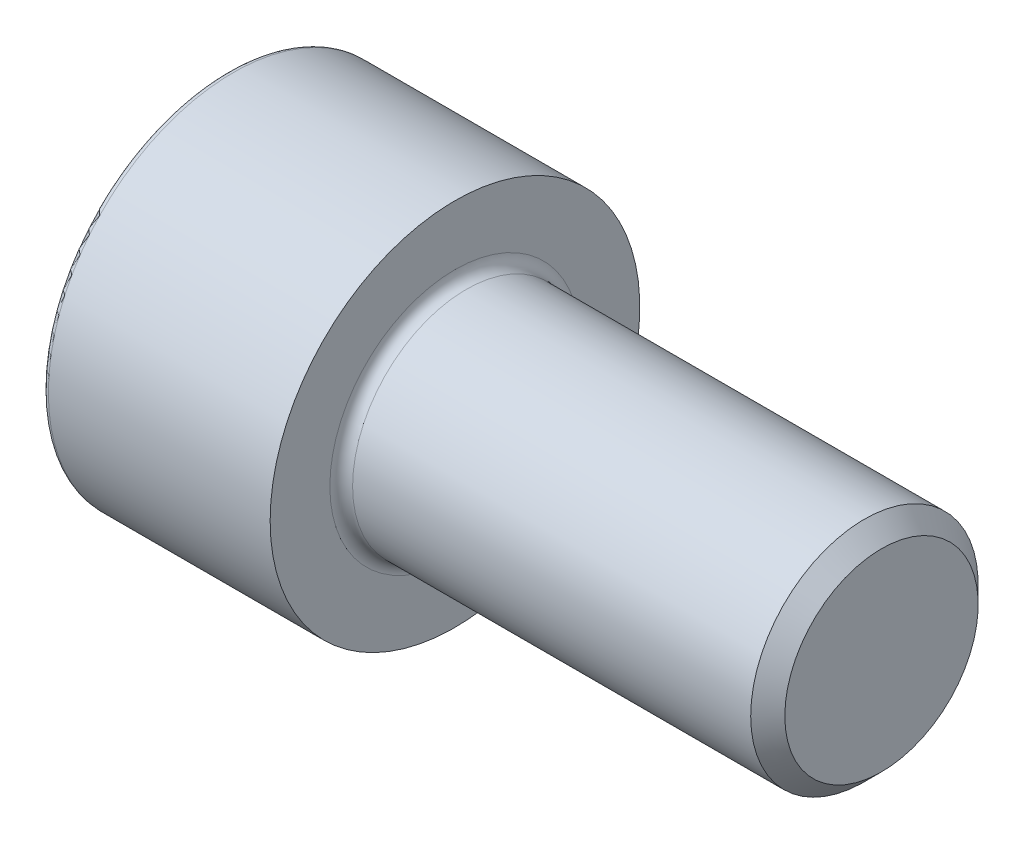
ISO-10303-21;
HEADER;
FILE_DESCRIPTION(('STEP AP214'),'2;1');
FILE_NAME('part.step','',(''),(''),'','','');
FILE_SCHEMA(('AUTOMOTIVE_DESIGN { 1 0 10303 214 1 1 1 1 }'));
ENDSEC;
DATA;
#1=APPLICATION_CONTEXT('core data for automotive mechanical design processes');
#2=APPLICATION_PROTOCOL_DEFINITION('international standard','automotive_design',2000,#1);
#3=PRODUCT_CONTEXT('',#1,'mechanical');
#4=PRODUCT('Part','Part','',(#3));
#5=PRODUCT_RELATED_PRODUCT_CATEGORY('part','',(#4));
#6=PRODUCT_DEFINITION_FORMATION('','',#4);
#7=PRODUCT_DEFINITION_CONTEXT('part definition',#1,'design');
#8=PRODUCT_DEFINITION('design','',#6,#7);
#9=PRODUCT_DEFINITION_SHAPE('','',#8);
#10=(LENGTH_UNIT() NAMED_UNIT(*) SI_UNIT(.MILLI.,.METRE.));
#11=(NAMED_UNIT(*) PLANE_ANGLE_UNIT() SI_UNIT($,.RADIAN.));
#12=(NAMED_UNIT(*) SI_UNIT($,.STERADIAN.) SOLID_ANGLE_UNIT());
#13=UNCERTAINTY_MEASURE_WITH_UNIT(LENGTH_MEASURE(1.E-05),#10,'distance_accuracy_value','');
#14=(GEOMETRIC_REPRESENTATION_CONTEXT(3) GLOBAL_UNCERTAINTY_ASSIGNED_CONTEXT((#13)) GLOBAL_UNIT_ASSIGNED_CONTEXT((#10,
#11,#12)) REPRESENTATION_CONTEXT('',''));
#15=CARTESIAN_POINT('',(0.,0.,0.));
#16=DIRECTION('',(0.,0.,1.));
#17=DIRECTION('',(1.,0.,0.));
#18=AXIS2_PLACEMENT_3D('',#15,#16,#17);
#19=CARTESIAN_POINT('',(0.,0.,0.));
#20=DIRECTION('',(1.,0.,0.));
#21=DIRECTION('',(0.,0.,-1.));
#22=AXIS2_PLACEMENT_3D('',#19,#20,#21);
#23=PLANE('',#22);
#24=CARTESIAN_POINT('',(0.,0.,0.));
#25=DIRECTION('',(1.,0.,0.));
#26=DIRECTION('',(0.,0.,-1.));
#27=AXIS2_PLACEMENT_3D('',#24,#25,#26);
#28=CIRCLE('',#27,6.3);
#29=CARTESIAN_POINT('',(0.,0.,-6.3));
#30=VERTEX_POINT('',#29);
#31=EDGE_CURVE('E180',#30,#30,#28,.F.);
#32=ORIENTED_EDGE('',*,*,#31,.T.);
#33=EDGE_LOOP('',(#32));
#34=FACE_BOUND('',#33,.T.);
#35=DIRECTION('',(0.,0.5,-0.866025403784439));
#36=VECTOR('',#35,1.);
#37=CARTESIAN_POINT('',(0.,1.73205080756887,3.));
#38=LINE('',#37,#36);
#39=CARTESIAN_POINT('',(0.,1.73205080756887,3.));
#40=VERTEX_POINT('',#39);
#41=CARTESIAN_POINT('',(0.,3.46410161513775,0.));
#42=VERTEX_POINT('',#41);
#43=EDGE_CURVE('E149',#40,#42,#38,.T.);
#44=ORIENTED_EDGE('',*,*,#43,.F.);
#45=DIRECTION('',(0.,1.,0.));
#46=VECTOR('',#45,1.);
#47=CARTESIAN_POINT('',(0.,-1.73205080756888,3.));
#48=LINE('',#47,#46);
#49=CARTESIAN_POINT('',(0.,-1.73205080756888,3.));
#50=VERTEX_POINT('',#49);
#51=EDGE_CURVE('E51',#50,#40,#48,.T.);
#52=ORIENTED_EDGE('',*,*,#51,.F.);
#53=DIRECTION('',(0.,0.5,0.866025403784439));
#54=VECTOR('',#53,1.);
#55=CARTESIAN_POINT('',(0.,-3.46410161513776,0.));
#56=LINE('',#55,#54);
#57=CARTESIAN_POINT('',(0.,-3.46410161513776,0.));
#58=VERTEX_POINT('',#57);
#59=EDGE_CURVE('E117',#58,#50,#56,.T.);
#60=ORIENTED_EDGE('',*,*,#59,.F.);
#61=DIRECTION('',(0.,-0.5,0.866025403784438));
#62=VECTOR('',#61,1.);
#63=CARTESIAN_POINT('',(0.,-1.73205080756888,-3.));
#64=LINE('',#63,#62);
#65=CARTESIAN_POINT('',(0.,-1.73205080756888,-3.));
#66=VERTEX_POINT('',#65);
#67=EDGE_CURVE('E157',#66,#58,#64,.T.);
#68=ORIENTED_EDGE('',*,*,#67,.F.);
#69=DIRECTION('',(0.,-1.,0.));
#70=VECTOR('',#69,1.);
#71=CARTESIAN_POINT('',(0.,1.73205080756887,-3.));
#72=LINE('',#71,#70);
#73=CARTESIAN_POINT('',(0.,1.73205080756887,-3.));
#74=VERTEX_POINT('',#73);
#75=EDGE_CURVE('E154',#74,#66,#72,.T.);
#76=ORIENTED_EDGE('',*,*,#75,.F.);
#77=DIRECTION('',(0.,-0.5,-0.866025403784438));
#78=VECTOR('',#77,1.);
#79=CARTESIAN_POINT('',(0.,3.46410161513775,0.));
#80=LINE('',#79,#78);
#81=EDGE_CURVE('E151',#42,#74,#80,.T.);
#82=ORIENTED_EDGE('',*,*,#81,.F.);
#83=EDGE_LOOP('',(#44,#52,#60,#68,#76,#82));
#84=FACE_BOUND('',#83,.T.);
#85=ADVANCED_FACE('F36',(#34,#84),#23,.F.);
#86=CARTESIAN_POINT('',(0.,0.,0.));
#87=DIRECTION('',(-1.,0.,0.));
#88=DIRECTION('',(0.,0.,1.));
#89=AXIS2_PLACEMENT_3D('',#86,#87,#88);
#90=CYLINDRICAL_SURFACE('',#89,6.5);
#91=CARTESIAN_POINT('',(0.2,0.,0.));
#92=DIRECTION('',(1.,0.,0.));
#93=DIRECTION('',(0.,0.,-1.));
#94=AXIS2_PLACEMENT_3D('',#91,#92,#93);
#95=CIRCLE('',#94,6.5);
#96=CARTESIAN_POINT('',(0.2,0.,-6.5));
#97=VERTEX_POINT('',#96);
#98=EDGE_CURVE('E183',#97,#97,#95,.T.);
#99=ORIENTED_EDGE('',*,*,#98,.T.);
#100=EDGE_LOOP('',(#99));
#101=FACE_BOUND('',#100,.T.);
#102=CARTESIAN_POINT('',(8.,0.,0.));
#103=DIRECTION('',(-1.,0.,0.));
#104=DIRECTION('',(0.,0.,1.));
#105=AXIS2_PLACEMENT_3D('',#102,#103,#104);
#106=CIRCLE('',#105,6.5);
#107=CARTESIAN_POINT('',(8.,0.,6.5));
#108=VERTEX_POINT('',#107);
#109=EDGE_CURVE('E176',#108,#108,#106,.T.);
#110=ORIENTED_EDGE('',*,*,#109,.T.);
#111=EDGE_LOOP('',(#110));
#112=FACE_BOUND('',#111,.T.);
#113=ADVANCED_FACE('F207',(#101,#112),#90,.T.);
#114=CARTESIAN_POINT('',(8.,6.5,0.));
#115=DIRECTION('',(-1.,0.,0.));
#116=DIRECTION('',(0.,0.,1.));
#117=AXIS2_PLACEMENT_3D('',#114,#115,#116);
#118=PLANE('',#117);
#119=CARTESIAN_POINT('',(8.,0.,0.));
#120=DIRECTION('',(-1.,0.,0.));
#121=DIRECTION('',(0.,0.,1.));
#122=AXIS2_PLACEMENT_3D('',#119,#120,#121);
#123=CIRCLE('',#122,4.4);
#124=CARTESIAN_POINT('',(8.,0.,4.4));
#125=VERTEX_POINT('',#124);
#126=EDGE_CURVE('E44',#125,#125,#123,.T.);
#127=ORIENTED_EDGE('',*,*,#126,.T.);
#128=EDGE_LOOP('',(#127));
#129=FACE_BOUND('',#128,.T.);
#130=ORIENTED_EDGE('',*,*,#109,.F.);
#131=EDGE_LOOP('',(#130));
#132=FACE_BOUND('',#131,.T.);
#133=ADVANCED_FACE('F194',(#129,#132),#118,.F.);
#134=CARTESIAN_POINT('',(0.,0.,0.));
#135=DIRECTION('',(-1.,0.,0.));
#136=DIRECTION('',(0.,0.,1.));
#137=AXIS2_PLACEMENT_3D('',#134,#135,#136);
#138=CYLINDRICAL_SURFACE('',#137,4.);
#139=CARTESIAN_POINT('',(8.4,0.,0.));
#140=DIRECTION('',(-1.,0.,0.));
#141=DIRECTION('',(0.,0.,1.));
#142=AXIS2_PLACEMENT_3D('',#139,#140,#141);
#143=CIRCLE('',#142,4.);
#144=CARTESIAN_POINT('',(8.4,0.,4.));
#145=VERTEX_POINT('',#144);
#146=EDGE_CURVE('E11',#145,#145,#143,.F.);
#147=ORIENTED_EDGE('',*,*,#146,.T.);
#148=EDGE_LOOP('',(#147));
#149=FACE_BOUND('',#148,.T.);
#150=CARTESIAN_POINT('',(22.4,0.,0.));
#151=DIRECTION('',(-1.,0.,0.));
#152=DIRECTION('',(0.,0.,1.));
#153=AXIS2_PLACEMENT_3D('',#150,#151,#152);
#154=CIRCLE('',#153,4.);
#155=CARTESIAN_POINT('',(22.4,0.,4.));
#156=VERTEX_POINT('',#155);
#157=EDGE_CURVE('E186',#156,#156,#154,.T.);
#158=ORIENTED_EDGE('',*,*,#157,.T.);
#159=EDGE_LOOP('',(#158));
#160=FACE_BOUND('',#159,.T.);
#161=ADVANCED_FACE('F232',(#149,#160),#138,.T.);
#162=CARTESIAN_POINT('',(23.,4.,0.));
#163=DIRECTION('',(-1.,0.,0.));
#164=DIRECTION('',(0.,0.,1.));
#165=AXIS2_PLACEMENT_3D('',#162,#163,#164);
#166=PLANE('',#165);
#167=CARTESIAN_POINT('',(23.,0.,0.));
#168=DIRECTION('',(-1.,0.,0.));
#169=DIRECTION('',(0.,0.,1.));
#170=AXIS2_PLACEMENT_3D('',#167,#168,#169);
#171=CIRCLE('',#170,3.4);
#172=CARTESIAN_POINT('',(23.,0.,3.4));
#173=VERTEX_POINT('',#172);
#174=EDGE_CURVE('E189',#173,#173,#171,.F.);
#175=ORIENTED_EDGE('',*,*,#174,.T.);
#176=EDGE_LOOP('',(#175));
#177=FACE_BOUND('',#176,.T.);
#178=ADVANCED_FACE('F236',(#177),#166,.F.);
#179=CARTESIAN_POINT('',(4.,-1.73205080756888,3.));
#180=DIRECTION('',(0.,0.,1.));
#181=DIRECTION('',(0.,-1.,0.));
#182=AXIS2_PLACEMENT_3D('',#179,#180,#181);
#183=PLANE('',#182);
#184=ORIENTED_EDGE('',*,*,#51,.T.);
#185=DIRECTION('',(-1.,0.,0.));
#186=VECTOR('',#185,1.);
#187=CARTESIAN_POINT('',(4.,1.73205080756887,3.));
#188=LINE('',#187,#186);
#189=CARTESIAN_POINT('',(4.,1.73205080756887,3.));
#190=VERTEX_POINT('',#189);
#191=EDGE_CURVE('E120',#190,#40,#188,.T.);
#192=ORIENTED_EDGE('',*,*,#191,.F.);
#193=DIRECTION('',(0.,1.,0.));
#194=VECTOR('',#193,1.);
#195=CARTESIAN_POINT('',(4.,-1.73205080756888,3.));
#196=LINE('',#195,#194);
#197=CARTESIAN_POINT('',(4.,0.,3.));
#198=VERTEX_POINT('',#197);
#199=EDGE_CURVE('E110',#198,#190,#196,.T.);
#200=ORIENTED_EDGE('',*,*,#199,.F.);
#201=CARTESIAN_POINT('',(4.,-1.73205080756888,3.));
#202=VERTEX_POINT('',#201);
#203=EDGE_CURVE('E116',#202,#198,#196,.T.);
#204=ORIENTED_EDGE('',*,*,#203,.F.);
#205=DIRECTION('',(-1.,0.,0.));
#206=VECTOR('',#205,1.);
#207=CARTESIAN_POINT('',(4.,-1.73205080756888,3.));
#208=LINE('',#207,#206);
#209=EDGE_CURVE('E161',#202,#50,#208,.T.);
#210=ORIENTED_EDGE('',*,*,#209,.T.);
#211=EDGE_LOOP('',(#184,#192,#200,#204,#210));
#212=FACE_BOUND('',#211,.T.);
#213=ADVANCED_FACE('F121',(#212),#183,.F.);
#214=CARTESIAN_POINT('',(4.,-3.46410161513776,0.));
#215=DIRECTION('',(0.,-0.866025403784439,0.5));
#216=DIRECTION('',(0.,-0.5,-0.866025403784439));
#217=AXIS2_PLACEMENT_3D('',#214,#215,#216);
#218=PLANE('',#217);
#219=ORIENTED_EDGE('',*,*,#59,.T.);
#220=ORIENTED_EDGE('',*,*,#209,.F.);
#221=DIRECTION('',(0.,0.5,0.866025403784439));
#222=VECTOR('',#221,1.);
#223=CARTESIAN_POINT('',(4.,-3.46410161513776,0.));
#224=LINE('',#223,#222);
#225=CARTESIAN_POINT('',(4.,-2.59807621135332,1.5));
#226=VERTEX_POINT('',#225);
#227=EDGE_CURVE('E145',#226,#202,#224,.T.);
#228=ORIENTED_EDGE('',*,*,#227,.F.);
#229=CARTESIAN_POINT('',(4.,-3.46410161513776,0.));
#230=VERTEX_POINT('',#229);
#231=EDGE_CURVE('E125',#230,#226,#224,.T.);
#232=ORIENTED_EDGE('',*,*,#231,.F.);
#233=DIRECTION('',(-1.,0.,0.));
#234=VECTOR('',#233,1.);
#235=CARTESIAN_POINT('',(4.,-3.46410161513776,0.));
#236=LINE('',#235,#234);
#237=EDGE_CURVE('E164',#230,#58,#236,.T.);
#238=ORIENTED_EDGE('',*,*,#237,.T.);
#239=EDGE_LOOP('',(#219,#220,#228,#232,#238));
#240=FACE_BOUND('',#239,.T.);
#241=ADVANCED_FACE('F245',(#240),#218,.F.);
#242=CARTESIAN_POINT('',(4.,-1.73205080756888,-3.));
#243=DIRECTION('',(0.,-0.866025403784438,-0.5));
#244=DIRECTION('',(0.,0.5,-0.866025403784439));
#245=AXIS2_PLACEMENT_3D('',#242,#243,#244);
#246=PLANE('',#245);
#247=ORIENTED_EDGE('',*,*,#67,.T.);
#248=ORIENTED_EDGE('',*,*,#237,.F.);
#249=DIRECTION('',(0.,-0.5,0.866025403784438));
#250=VECTOR('',#249,1.);
#251=CARTESIAN_POINT('',(4.,-1.73205080756888,-3.));
#252=LINE('',#251,#250);
#253=CARTESIAN_POINT('',(4.,-2.59807621135332,-1.5));
#254=VERTEX_POINT('',#253);
#255=EDGE_CURVE('E141',#254,#230,#252,.T.);
#256=ORIENTED_EDGE('',*,*,#255,.F.);
#257=CARTESIAN_POINT('',(4.,-1.73205080756888,-3.));
#258=VERTEX_POINT('',#257);
#259=EDGE_CURVE('E142',#258,#254,#252,.T.);
#260=ORIENTED_EDGE('',*,*,#259,.F.);
#261=DIRECTION('',(-1.,0.,0.));
#262=VECTOR('',#261,1.);
#263=CARTESIAN_POINT('',(4.,-1.73205080756888,-3.));
#264=LINE('',#263,#262);
#265=EDGE_CURVE('E167',#258,#66,#264,.T.);
#266=ORIENTED_EDGE('',*,*,#265,.T.);
#267=EDGE_LOOP('',(#247,#248,#256,#260,#266));
#268=FACE_BOUND('',#267,.T.);
#269=ADVANCED_FACE('F256',(#268),#246,.F.);
#270=CARTESIAN_POINT('',(4.,1.73205080756887,-3.));
#271=DIRECTION('',(0.,0.,-1.));
#272=DIRECTION('',(0.,1.,0.));
#273=AXIS2_PLACEMENT_3D('',#270,#271,#272);
#274=PLANE('',#273);
#275=ORIENTED_EDGE('',*,*,#75,.T.);
#276=ORIENTED_EDGE('',*,*,#265,.F.);
#277=DIRECTION('',(0.,-1.,0.));
#278=VECTOR('',#277,1.);
#279=CARTESIAN_POINT('',(4.,1.73205080756887,-3.));
#280=LINE('',#279,#278);
#281=CARTESIAN_POINT('',(4.,0.,-3.));
#282=VERTEX_POINT('',#281);
#283=EDGE_CURVE('E137',#282,#258,#280,.T.);
#284=ORIENTED_EDGE('',*,*,#283,.F.);
#285=CARTESIAN_POINT('',(4.,1.73205080756887,-3.));
#286=VERTEX_POINT('',#285);
#287=EDGE_CURVE('E138',#286,#282,#280,.T.);
#288=ORIENTED_EDGE('',*,*,#287,.F.);
#289=DIRECTION('',(-1.,0.,0.));
#290=VECTOR('',#289,1.);
#291=CARTESIAN_POINT('',(4.,1.73205080756887,-3.));
#292=LINE('',#291,#290);
#293=EDGE_CURVE('E170',#286,#74,#292,.T.);
#294=ORIENTED_EDGE('',*,*,#293,.T.);
#295=EDGE_LOOP('',(#275,#276,#284,#288,#294));
#296=FACE_BOUND('',#295,.T.);
#297=ADVANCED_FACE('F252',(#296),#274,.F.);
#298=CARTESIAN_POINT('',(4.,3.46410161513775,0.));
#299=DIRECTION('',(0.,0.866025403784439,-0.5));
#300=DIRECTION('',(0.,0.5,0.866025403784439));
#301=AXIS2_PLACEMENT_3D('',#298,#299,#300);
#302=PLANE('',#301);
#303=ORIENTED_EDGE('',*,*,#81,.T.);
#304=ORIENTED_EDGE('',*,*,#293,.F.);
#305=DIRECTION('',(0.,-0.5,-0.866025403784438));
#306=VECTOR('',#305,1.);
#307=CARTESIAN_POINT('',(4.,3.46410161513775,0.));
#308=LINE('',#307,#306);
#309=CARTESIAN_POINT('',(4.,2.59807621135331,-1.5));
#310=VERTEX_POINT('',#309);
#311=EDGE_CURVE('E131',#310,#286,#308,.T.);
#312=ORIENTED_EDGE('',*,*,#311,.F.);
#313=CARTESIAN_POINT('',(4.,3.46410161513775,0.));
#314=VERTEX_POINT('',#313);
#315=EDGE_CURVE('E133',#314,#310,#308,.T.);
#316=ORIENTED_EDGE('',*,*,#315,.F.);
#317=DIRECTION('',(-1.,0.,0.));
#318=VECTOR('',#317,1.);
#319=CARTESIAN_POINT('',(4.,3.46410161513775,0.));
#320=LINE('',#319,#318);
#321=EDGE_CURVE('E124',#314,#42,#320,.T.);
#322=ORIENTED_EDGE('',*,*,#321,.T.);
#323=EDGE_LOOP('',(#303,#304,#312,#316,#322));
#324=FACE_BOUND('',#323,.T.);
#325=ADVANCED_FACE('F249',(#324),#302,.F.);
#326=CARTESIAN_POINT('',(4.,1.73205080756887,3.));
#327=DIRECTION('',(0.,0.866025403784439,0.5));
#328=DIRECTION('',(0.,-0.5,0.866025403784439));
#329=AXIS2_PLACEMENT_3D('',#326,#327,#328);
#330=PLANE('',#329);
#331=ORIENTED_EDGE('',*,*,#43,.T.);
#332=ORIENTED_EDGE('',*,*,#321,.F.);
#333=DIRECTION('',(0.,0.5,-0.866025403784439));
#334=VECTOR('',#333,1.);
#335=CARTESIAN_POINT('',(4.,1.73205080756887,3.));
#336=LINE('',#335,#334);
#337=CARTESIAN_POINT('',(4.,2.59807621135331,1.5));
#338=VERTEX_POINT('',#337);
#339=EDGE_CURVE('E129',#338,#314,#336,.T.);
#340=ORIENTED_EDGE('',*,*,#339,.F.);
#341=EDGE_CURVE('E59',#190,#338,#336,.T.);
#342=ORIENTED_EDGE('',*,*,#341,.F.);
#343=ORIENTED_EDGE('',*,*,#191,.T.);
#344=EDGE_LOOP('',(#331,#332,#340,#342,#343));
#345=FACE_BOUND('',#344,.T.);
#346=ADVANCED_FACE('F127',(#345),#330,.F.);
#347=CARTESIAN_POINT('',(4.,0.,0.));
#348=DIRECTION('',(-1.,0.,0.));
#349=DIRECTION('',(0.,0.,1.));
#350=AXIS2_PLACEMENT_3D('',#347,#348,#349);
#351=PLANE('',#350);
#352=CARTESIAN_POINT('',(4.,0.,0.));
#353=DIRECTION('',(-1.,0.,0.));
#354=DIRECTION('',(0.,0.,1.));
#355=AXIS2_PLACEMENT_3D('',#352,#353,#354);
#356=CIRCLE('',#355,3.);
#357=EDGE_CURVE('E163',#226,#198,#356,.T.);
#358=ORIENTED_EDGE('',*,*,#357,.F.);
#359=ORIENTED_EDGE('',*,*,#227,.T.);
#360=ORIENTED_EDGE('',*,*,#203,.T.);
#361=EDGE_LOOP('',(#358,#359,#360));
#362=FACE_BOUND('',#361,.T.);
#363=ADVANCED_FACE('F248',(#362),#351,.T.);
#364=EDGE_CURVE('E291',#254,#226,#356,.T.);
#365=ORIENTED_EDGE('',*,*,#364,.F.);
#366=ORIENTED_EDGE('',*,*,#255,.T.);
#367=ORIENTED_EDGE('',*,*,#231,.T.);
#368=EDGE_LOOP('',(#365,#366,#367));
#369=FACE_BOUND('',#368,.T.);
#370=ADVANCED_FACE('F265',(#369),#351,.T.);
#371=EDGE_CURVE('E293',#282,#254,#356,.T.);
#372=ORIENTED_EDGE('',*,*,#371,.F.);
#373=ORIENTED_EDGE('',*,*,#283,.T.);
#374=ORIENTED_EDGE('',*,*,#259,.T.);
#375=EDGE_LOOP('',(#372,#373,#374));
#376=FACE_BOUND('',#375,.T.);
#377=ADVANCED_FACE('F270',(#376),#351,.T.);
#378=EDGE_CURVE('E287',#310,#282,#356,.T.);
#379=ORIENTED_EDGE('',*,*,#378,.F.);
#380=ORIENTED_EDGE('',*,*,#311,.T.);
#381=ORIENTED_EDGE('',*,*,#287,.T.);
#382=EDGE_LOOP('',(#379,#380,#381));
#383=FACE_BOUND('',#382,.T.);
#384=ADVANCED_FACE('F277',(#383),#351,.T.);
#385=EDGE_CURVE('E177',#338,#310,#356,.T.);
#386=ORIENTED_EDGE('',*,*,#385,.F.);
#387=ORIENTED_EDGE('',*,*,#339,.T.);
#388=ORIENTED_EDGE('',*,*,#315,.T.);
#389=EDGE_LOOP('',(#386,#387,#388));
#390=FACE_BOUND('',#389,.T.);
#391=ADVANCED_FACE('F273',(#390),#351,.T.);
#392=EDGE_CURVE('E113',#198,#338,#356,.T.);
#393=ORIENTED_EDGE('',*,*,#392,.F.);
#394=ORIENTED_EDGE('',*,*,#199,.T.);
#395=ORIENTED_EDGE('',*,*,#341,.T.);
#396=EDGE_LOOP('',(#393,#394,#395));
#397=FACE_BOUND('',#396,.T.);
#398=ADVANCED_FACE('F111',(#397),#351,.T.);
#399=CARTESIAN_POINT('',(4.,0.,0.));
#400=DIRECTION('',(-1.,0.,0.));
#401=DIRECTION('',(0.,0.,1.));
#402=AXIS2_PLACEMENT_3D('',#399,#400,#401);
#403=CONICAL_SURFACE('',#402,3.,1.02974425867665);
#404=CARTESIAN_POINT('',(5.80258185708268,0.,0.));
#405=VERTEX_POINT('',#404);
#406=VERTEX_LOOP('',#405);
#407=FACE_BOUND('',#406,.T.);
#408=ORIENTED_EDGE('',*,*,#392,.T.);
#409=ORIENTED_EDGE('',*,*,#385,.T.);
#410=ORIENTED_EDGE('',*,*,#378,.T.);
#411=ORIENTED_EDGE('',*,*,#371,.T.);
#412=ORIENTED_EDGE('',*,*,#364,.T.);
#413=ORIENTED_EDGE('',*,*,#357,.T.);
#414=EDGE_LOOP('',(#408,#409,#410,#411,#412,#413));
#415=FACE_BOUND('',#414,.T.);
#416=ADVANCED_FACE('F219',(#407,#415),#403,.F.);
#417=CARTESIAN_POINT('',(0.2,0.,0.));
#418=DIRECTION('',(1.,0.,0.));
#419=DIRECTION('',(0.,0.,-1.));
#420=AXIS2_PLACEMENT_3D('',#417,#418,#419);
#421=TOROIDAL_SURFACE('',#420,6.3,0.2);
#422=ORIENTED_EDGE('',*,*,#98,.F.);
#423=EDGE_LOOP('',(#422));
#424=FACE_BOUND('',#423,.T.);
#425=ORIENTED_EDGE('',*,*,#31,.F.);
#426=EDGE_LOOP('',(#425));
#427=FACE_BOUND('',#426,.T.);
#428=ADVANCED_FACE('F203',(#424,#427),#421,.T.);
#429=CARTESIAN_POINT('',(22.4,0.,0.));
#430=DIRECTION('',(-1.,0.,0.));
#431=DIRECTION('',(0.,0.,1.));
#432=AXIS2_PLACEMENT_3D('',#429,#430,#431);
#433=CONICAL_SURFACE('',#432,4.,0.785398163397451);
#434=ORIENTED_EDGE('',*,*,#174,.F.);
#435=EDGE_LOOP('',(#434));
#436=FACE_BOUND('',#435,.T.);
#437=ORIENTED_EDGE('',*,*,#157,.F.);
#438=EDGE_LOOP('',(#437));
#439=FACE_BOUND('',#438,.T.);
#440=ADVANCED_FACE('F198',(#436,#439),#433,.T.);
#441=CARTESIAN_POINT('',(8.4,0.,0.));
#442=DIRECTION('',(-1.,0.,0.));
#443=DIRECTION('',(0.,0.,1.));
#444=AXIS2_PLACEMENT_3D('',#441,#442,#443);
#445=TOROIDAL_SURFACE('',#444,4.4,0.4);
#446=ORIENTED_EDGE('',*,*,#146,.F.);
#447=EDGE_LOOP('',(#446));
#448=FACE_BOUND('',#447,.T.);
#449=ORIENTED_EDGE('',*,*,#126,.F.);
#450=EDGE_LOOP('',(#449));
#451=FACE_BOUND('',#450,.T.);
#452=ADVANCED_FACE('F38',(#448,#451),#445,.F.);
#453=CLOSED_SHELL('',(#85,#113,#133,#161,#178,#213,#241,#269,#297,#325,#346,#363,#370,#377,#384,
#391,#398,#416,#428,#440,#452));
#454=MANIFOLD_SOLID_BREP('B2',#453);
#455=ADVANCED_BREP_SHAPE_REPRESENTATION('',(#18,#454),#14);
#456=SHAPE_DEFINITION_REPRESENTATION(#9,#455);
ENDSEC;
END-ISO-10303-21;
